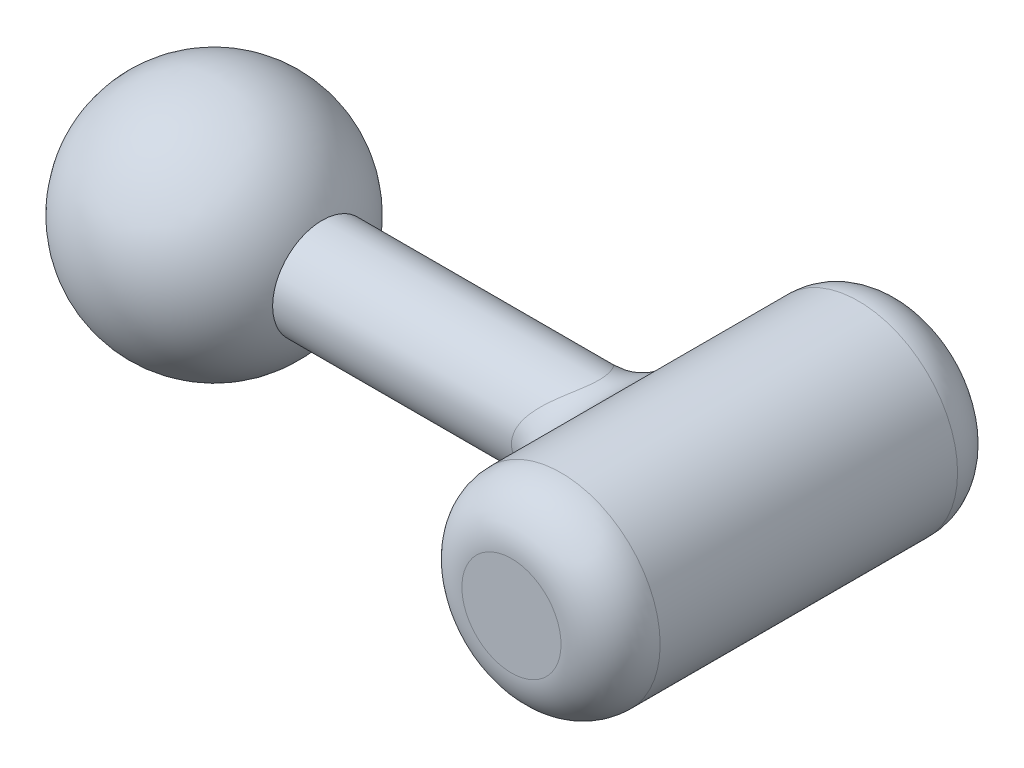
ISO-10303-21;
HEADER;
FILE_DESCRIPTION(('STEP AP214'),'2;1');
FILE_NAME('part.step','',(''),(''),'','','');
FILE_SCHEMA(('AUTOMOTIVE_DESIGN { 1 0 10303 214 1 1 1 1 }'));
ENDSEC;
DATA;
#1=APPLICATION_CONTEXT('core data for automotive mechanical design processes');
#2=APPLICATION_PROTOCOL_DEFINITION('international standard','automotive_design',2000,#1);
#3=PRODUCT_CONTEXT('',#1,'mechanical');
#4=PRODUCT('Part','Part','',(#3));
#5=PRODUCT_RELATED_PRODUCT_CATEGORY('part','',(#4));
#6=PRODUCT_DEFINITION_FORMATION('','',#4);
#7=PRODUCT_DEFINITION_CONTEXT('part definition',#1,'design');
#8=PRODUCT_DEFINITION('design','',#6,#7);
#9=PRODUCT_DEFINITION_SHAPE('','',#8);
#10=(LENGTH_UNIT() NAMED_UNIT(*) SI_UNIT(.MILLI.,.METRE.));
#11=(NAMED_UNIT(*) PLANE_ANGLE_UNIT() SI_UNIT($,.RADIAN.));
#12=(NAMED_UNIT(*) SI_UNIT($,.STERADIAN.) SOLID_ANGLE_UNIT());
#13=UNCERTAINTY_MEASURE_WITH_UNIT(LENGTH_MEASURE(1.E-05),#10,'distance_accuracy_value','');
#14=(GEOMETRIC_REPRESENTATION_CONTEXT(3) GLOBAL_UNCERTAINTY_ASSIGNED_CONTEXT((#13)) GLOBAL_UNIT_ASSIGNED_CONTEXT((#10,
#11,#12)) REPRESENTATION_CONTEXT('',''));
#15=CARTESIAN_POINT('',(0.,0.,0.));
#16=DIRECTION('',(0.,0.,1.));
#17=DIRECTION('',(1.,0.,0.));
#18=AXIS2_PLACEMENT_3D('',#15,#16,#17);
#19=CARTESIAN_POINT('',(0.,0.,0.));
#20=DIRECTION('',(-1.,0.,0.));
#21=DIRECTION('',(0.,0.,1.));
#22=AXIS2_PLACEMENT_3D('',#19,#20,#21);
#23=CYLINDRICAL_SURFACE('',#22,0.5);
#24=CARTESIAN_POINT('',(3.52184133478082,-0.127521528023176,0.483464848660825));
#25=CARTESIAN_POINT('',(3.99408232900824,-0.0513406572577382,0.503558762568019));
#26=CARTESIAN_POINT('',(4.01456088985388,-0.170028704030901,0.966929697321651));
#27=CARTESIAN_POINT('',(3.51279105015493,-0.101298561184406,0.490382051084357));
#28=CARTESIAN_POINT('',(3.99600272163948,-0.0371651215625281,0.502847882715051));
#29=CARTESIAN_POINT('',(4.0085273667444,-0.135064748251369,0.980764102150087));
#30=CARTESIAN_POINT('',(3.50637140856018,-0.0742951002939881,0.495211928569736));
#31=CARTESIAN_POINT('',(3.99797185160982,-0.0259994538347663,0.501463016054571));
#32=CARTESIAN_POINT('',(4.00424760574301,-0.0990601337266775,0.990423857172238));
#33=CARTESIAN_POINT('',(3.49952218501938,-0.0196820859834694,0.50036242436762));
#34=CARTESIAN_POINT('',(4.00012267876693,-0.00617576688331964,0.499933571702085));
#35=CARTESIAN_POINT('',(3.99968145672312,-0.0262427813093579,1.00072484877287));
#36=CARTESIAN_POINT('',(3.49908691348038,0.00792686674692009,0.500687325753362));
#37=CARTESIAN_POINT('',(4.00028115234244,0.00235001943824985,0.499805328114803));
#38=CARTESIAN_POINT('',(3.99939127564276,0.0105691556636595,1.00137465149792));
#39=CARTESIAN_POINT('',(3.50388769808663,0.0589517425504064,0.497080442716341));
#40=CARTESIAN_POINT('',(3.9987429595436,0.0202267642882431,0.500919130396378));
#41=CARTESIAN_POINT('',(4.00259179873377,0.0786023233995912,0.994160885440297));
#42=CARTESIAN_POINT('',(3.50836407206887,0.0824293818000019,0.493718880152731));
#43=CARTESIAN_POINT('',(3.99730822954323,0.0292179252954743,0.501968014962014));
#44=CARTESIAN_POINT('',(4.00557604811335,0.109905842397904,0.987437760361993));
#45=CARTESIAN_POINT('',(3.52142588526069,0.12843331478388,0.483796809867336));
#46=CARTESIAN_POINT('',(3.99406926081824,0.0510499910323585,0.503678331613825));
#47=CARTESIAN_POINT('',(4.01428392356768,0.171244419711325,0.967593619786328));
#48=CARTESIAN_POINT('',(3.53001771771324,0.150958068786396,0.477231324647378));
#49=CARTESIAN_POINT('',(3.99228098723203,0.0637685221540652,0.504337660900992));
#50=CARTESIAN_POINT('',(4.02001181180422,0.201277425050752,0.954462649292458));
#51=CARTESIAN_POINT('',(3.55087825134442,0.195030689511506,0.461007506643267));
#52=CARTESIAN_POINT('',(3.98975921687694,0.0938960487815295,0.503253846462975));
#53=CARTESIAN_POINT('',(4.03391883423432,0.260040919346398,0.922015013288886));
#54=CARTESIAN_POINT('',(3.56322875488546,0.21654307247903,0.451279997966832));
#55=CARTESIAN_POINT('',(3.98903685007,0.111249628691008,0.501502677985305));
#56=CARTESIAN_POINT('',(4.04215250333949,0.288724096628954,0.902559995997294));
#57=CARTESIAN_POINT('',(3.59063648737916,0.257671264009091,0.429129432036974));
#58=CARTESIAN_POINT('',(3.98984362559684,0.1494320747783,0.493776517048959));
#59=CARTESIAN_POINT('',(4.06042432496021,0.343561685362423,0.858258864144806));
#60=CARTESIAN_POINT('',(3.60569615012495,0.277285342646482,0.416703948943551));
#61=CARTESIAN_POINT('',(3.99132379349418,0.170131873082272,0.487902394555358));
#62=CARTESIAN_POINT('',(4.07046410000434,0.369713790246514,0.833407897903804));
#63=CARTESIAN_POINT('',(3.63985447028322,0.317071931707186,0.38750408733394));
#64=CARTESIAN_POINT('',(3.99728669365949,0.216214668318688,0.469832781824353));
#65=CARTESIAN_POINT('',(4.09323631361252,0.422762575550977,0.775008174648765));
#66=CARTESIAN_POINT('',(3.6592223104645,0.336915548908681,0.370360734727741));
#67=CARTESIAN_POINT('',(4.00209597772938,0.241853147250298,0.456987861569799));
#68=CARTESIAN_POINT('',(4.10614820741734,0.449220731649114,0.740721469466311));
#69=CARTESIAN_POINT('',(3.6987225630732,0.373637885412264,0.33328251354333));
#70=CARTESIAN_POINT('',(4.01459029971212,0.292566546928896,0.424278068624746));
#71=CARTESIAN_POINT('',(4.13248170917753,0.498183846983091,0.666565027110476));
#72=CARTESIAN_POINT('',(3.71885633302959,0.390511010691349,0.313342502484164));
#73=CARTESIAN_POINT('',(4.02221583467539,0.317688786576455,0.404556965111983));
#74=CARTESIAN_POINT('',(4.14590422215093,0.520681347522223,0.626685004975099));
#75=CARTESIAN_POINT('',(3.76094215426141,0.423216407964524,0.267916134077052));
#76=CARTESIAN_POINT('',(4.04015941206066,0.368261764980205,0.355321042130125));
#77=CARTESIAN_POINT('',(4.17396143602454,0.564288544028295,0.535832268146376));
#78=CARTESIAN_POINT('',(3.78274945886824,0.438565196230507,0.242044186994596));
#79=CARTESIAN_POINT('',(4.05072574700281,0.393540382674414,0.324836014519819));
#80=CARTESIAN_POINT('',(4.18849963920603,0.584753594993952,0.484088373987115));
#81=CARTESIAN_POINT('',(3.8219756804017,0.46457630820016,0.187298859084677));
#82=CARTESIAN_POINT('',(4.07098339663499,0.437264155373368,0.256431863751106));
#83=CARTESIAN_POINT('',(4.21465045364048,0.619435077580325,0.374597718171424));
#84=CARTESIAN_POINT('',(3.83940646077911,0.475251360806728,0.158433898622795));
#85=CARTESIAN_POINT('',(4.08075415452958,0.455992280635637,0.218478741485344));
#86=CARTESIAN_POINT('',(4.22627097386101,0.633668481071377,0.316867797246175));
#87=CARTESIAN_POINT('',(3.86206786377889,0.488701581086932,0.10781787904234));
#88=CARTESIAN_POINT('',(4.09374900449104,0.479732237292894,0.150005978420062));
#89=CARTESIAN_POINT('',(4.24137857584692,0.65160210811883,0.215635758084279));
#90=CARTESIAN_POINT('',(3.86941128359993,0.492905323764195,0.0866839175618371));
#91=CARTESIAN_POINT('',(4.09809439558991,0.487267182814136,0.120891348248992));
#92=CARTESIAN_POINT('',(4.246274189066,0.657207098352758,0.173367835123295));
#93=CARTESIAN_POINT('',(3.87934626653993,0.498546569004365,0.04378887161618));
#94=CARTESIAN_POINT('',(4.10398525481408,0.497364632985375,0.0613679141402255));
#95=CARTESIAN_POINT('',(4.25289751102724,0.664728758671989,0.0875777432327389));
#96=CARTESIAN_POINT('',(3.88194498621205,0.499988237836604,0.0220287820011238));
#97=CARTESIAN_POINT('',(4.10556023751805,0.499978764521799,0.030837978087025));
#98=CARTESIAN_POINT('',(4.25462999080487,0.666650983783063,0.0440575640033621));
#99=CARTESIAN_POINT('',(3.88198681150441,0.500011636518554,-0.0215262974261801));
#100=CARTESIAN_POINT('',(4.10558524531233,0.500021009015589,-0.0301339239258896));
#101=CARTESIAN_POINT('',(4.25465787433945,0.666682182023813,-0.0430525948534764));
#102=CARTESIAN_POINT('',(3.879422237503,0.498589106303372,-0.0433212909765641));
#103=CARTESIAN_POINT('',(4.10403072668619,0.497441583165691,-0.0607161420762655));
#104=CARTESIAN_POINT('',(4.25294815834867,0.66478547506696,-0.086642581957216));
#105=CARTESIAN_POINT('',(3.86953511059225,0.492976192990467,-0.0862868130132932));
#106=CARTESIAN_POINT('',(4.0981675641146,0.487393499579897,-0.120342774304106));
#107=CARTESIAN_POINT('',(4.24635674038149,0.657301590658164,-0.172573626022493));
#108=CARTESIAN_POINT('',(3.86220602885591,0.488782011755921,-0.107456442884957));
#109=CARTESIAN_POINT('',(4.09382978087993,0.479873905794808,-0.149509335912176));
#110=CARTESIAN_POINT('',(4.24147068585369,0.651709349023811,-0.214912885754647));
#111=CARTESIAN_POINT('',(3.84157071769575,0.476537818724537,-0.153664569281474));
#112=CARTESIAN_POINT('',(4.082004385782,0.458283414485092,-0.211978959551758));
#113=CARTESIAN_POINT('',(4.22771381185953,0.635383758279628,-0.307329138581895));
#114=CARTESIAN_POINT('',(3.82724945080516,0.467801984961387,-0.178405325277322));
#115=CARTESIAN_POINT('',(4.07396021170135,0.44296765673279,-0.244649724554584));
#116=CARTESIAN_POINT('',(4.21816630079575,0.623735979866456,-0.35681065063326));
#117=CARTESIAN_POINT('',(3.79506638429841,0.446886214565755,-0.225754919753516));
#118=CARTESIAN_POINT('',(4.0569963056958,0.407488122617496,-0.304714541812882));
#119=CARTESIAN_POINT('',(4.19671092312269,0.595848286004523,-0.451509839582065));
#120=CARTESIAN_POINT('',(3.77719989790207,0.434701709599361,-0.248360877008813));
#121=CARTESIAN_POINT('',(4.04802073393314,0.38715311891021,-0.332155144394157));
#122=CARTESIAN_POINT('',(4.18479993199277,0.579602279444043,-0.496721754029241));
#123=CARTESIAN_POINT('',(3.73959569760923,0.406977599317246,-0.29161702381691));
#124=CARTESIAN_POINT('',(4.03080476414889,0.342932723573309,-0.381560506993048));
#125=CARTESIAN_POINT('',(4.15973046501373,0.542636799111822,-0.583234047621998));
#126=CARTESIAN_POINT('',(3.71983025483009,0.391381940036078,-0.312225055027575));
#127=CARTESIAN_POINT('',(4.02257284688558,0.318849191526074,-0.403364816412132));
#128=CARTESIAN_POINT('',(4.14655350324792,0.521842586718055,-0.624450110085175));
#129=CARTESIAN_POINT('',(3.68044163576962,0.35718565222604,-0.350833434405619));
#130=CARTESIAN_POINT('',(4.00841688584878,0.26937127462844,-0.440486628881959));
#131=CARTESIAN_POINT('',(4.12029442381853,0.476247536298101,-0.701666868781194));
#132=CARTESIAN_POINT('',(3.66081855355211,0.33858319778756,-0.368832185380648));
#133=CARTESIAN_POINT('',(4.00253949968741,0.243894880663175,-0.455670416496009));
#134=CARTESIAN_POINT('',(4.10721236886401,0.451444263725784,-0.737664370629248));
#135=CARTESIAN_POINT('',(3.62020449683853,0.295296540872935,-0.404610668570646));
#136=CARTESIAN_POINT('',(3.99318872772914,0.189806965083974,-0.481561796676338));
#137=CARTESIAN_POINT('',(4.08013633142409,0.393728721153411,-0.809221337294745));
#138=CARTESIAN_POINT('',(3.599507419002,0.270115292679919,-0.421881945774981));
#139=CARTESIAN_POINT('',(3.99040990262114,0.161539563328819,-0.490816213384731));
#140=CARTESIAN_POINT('',(4.06633828015495,0.360153723523373,-0.843763892172953));
#141=CARTESIAN_POINT('',(3.56270355183905,0.216442377652482,-0.451766521225882));
#142=CARTESIAN_POINT('',(3.98876440269612,0.110417204152977,-0.502090548408749));
#143=CARTESIAN_POINT('',(4.0418023687234,0.28858983681865,-0.90353304308108));
#144=CARTESIAN_POINT('',(3.54658384852199,0.187960349876281,-0.464392954202645));
#145=CARTESIAN_POINT('',(3.99001092271661,0.0878341617116402,-0.503881710581803));
#146=CARTESIAN_POINT('',(4.03105589923741,0.25061379982137,-0.928785908574047));
#147=CARTESIAN_POINT('',(3.52072021149345,0.127988454385187,-0.484383316511721));
#148=CARTESIAN_POINT('',(3.99390747775483,0.0498896360511994,-0.504098001590069));
#149=CARTESIAN_POINT('',(4.01381347410303,0.17065127252745,-0.968766632852271));
#150=CARTESIAN_POINT('',(3.51107081975549,0.0964613757069334,-0.491669350715534));
#151=CARTESIAN_POINT('',(3.99658921050644,0.0350397792621662,-0.502389648174329));
#152=CARTESIAN_POINT('',(4.0073805464481,0.128615167612305,-0.983338701388937));
#153=CARTESIAN_POINT('',(3.50140907438057,0.0404531164859,-0.498946866562786));
#154=CARTESIAN_POINT('',(3.99949220597319,0.0132913358810754,-0.500406555939149));
#155=CARTESIAN_POINT('',(4.00093938296179,0.0539374886455855,-0.997893733156976));
#156=CARTESIAN_POINT('',(3.49956853650609,0.0162218229495406,-0.500323312126748));
#157=CARTESIAN_POINT('',(4.00014427054412,0.00543340310684889,-0.499891013579184));
#158=CARTESIAN_POINT('',(3.99971235768976,0.0216290972657961,-1.00064662426802));
#159=CARTESIAN_POINT('',(3.50060136621171,-0.0321856874239827,-0.499549256578989));
#160=CARTESIAN_POINT('',(3.99979931619985,-0.0107508536418068,-0.500151268980534));
#161=CARTESIAN_POINT('',(4.00040091079033,-0.0429142498983834,-0.999098513144836));
#162=CARTESIAN_POINT('',(3.50347863346425,-0.0563618421399533,-0.49739583773064));
#163=CARTESIAN_POINT('',(3.99880426811833,-0.0190005490565779,-0.500925570106477));
#164=CARTESIAN_POINT('',(4.00231908894456,-0.0751491228545185,-0.994791675437361));
#165=CARTESIAN_POINT('',(3.51367672543545,-0.10382386878632,-0.489691058016191));
#166=CARTESIAN_POINT('',(3.99592454335499,-0.0387862312049883,-0.502753661100116));
#167=CARTESIAN_POINT('',(4.00911781698846,-0.138431825047184,-0.979382116056216));
#168=CARTESIAN_POINT('',(3.52098170127544,-0.127112602654453,-0.484151816029614));
#169=CARTESIAN_POINT('',(3.99406385391302,-0.0501950587926409,-0.503796023836604));
#170=CARTESIAN_POINT('',(4.01398780095867,-0.169483470200716,-0.968303632141344));
#171=CARTESIAN_POINT('',(3.53941373555008,-0.172355688773135,-0.469954439183359));
#172=CARTESIAN_POINT('',(3.99094744377844,-0.0775519302210858,-0.504132889359818));
#173=CARTESIAN_POINT('',(4.02627582379665,-0.229807585026489,-0.9399088784384));
#174=CARTESIAN_POINT('',(3.55054810033396,-0.194307395080862,-0.461290340649657));
#175=CARTESIAN_POINT('',(3.98969227428277,-0.0933486155710695,-0.503452359880575));
#176=CARTESIAN_POINT('',(4.03369873356359,-0.259076526774984,-0.922580681302038));
#177=CARTESIAN_POINT('',(3.5763581118039,-0.237356815517952,-0.440744639642371));
#178=CARTESIAN_POINT('',(3.98909645949429,-0.129634908149363,-0.498310692985403));
#179=CARTESIAN_POINT('',(4.05090540786132,-0.316475754023412,-0.881489279281897));
#180=CARTESIAN_POINT('',(3.59116844425149,-0.258373991802501,-0.428737832820021));
#181=CARTESIAN_POINT('',(3.98979847945146,-0.150153403711364,-0.493777974502008));
#182=CARTESIAN_POINT('',(4.06077896290714,-0.344498655729776,-0.857475665706568));
#183=CARTESIAN_POINT('',(3.62298734962222,-0.298194077948018,-0.402064180361248));
#184=CARTESIAN_POINT('',(3.99397503979462,-0.193611601059413,-0.479403857366444));
#185=CARTESIAN_POINT('',(4.08199156640208,-0.397592103969832,-0.804128360781921));
#186=CARTESIAN_POINT('',(3.63999784634243,-0.316995022134595,-0.387395002199136));
#187=CARTESIAN_POINT('',(3.99738250312868,-0.216462704673681,-0.469695703239499));
#188=CARTESIAN_POINT('',(4.09333189738237,-0.422660029604387,-0.774790004381096));
#189=CARTESIAN_POINT('',(3.67797285521593,-0.355083799506232,-0.353094866286753));
#190=CARTESIAN_POINT('',(4.00755787920031,-0.266140588961338,-0.442530188504588));
#191=CARTESIAN_POINT('',(4.11864857035257,-0.473445065901713,-0.706189732593497));
#192=CARTESIAN_POINT('',(3.69912863684804,-0.373946950526896,-0.333044749627684));
#193=CARTESIAN_POINT('',(4.01472097167133,-0.293122143340078,-0.424192295148512));
#194=CARTESIAN_POINT('',(4.13275242545092,-0.498595933627569,-0.666089499422367));
#195=CARTESIAN_POINT('',(3.74099503986073,-0.408202847376977,-0.290045688357789));
#196=CARTESIAN_POINT('',(4.03129312254594,-0.344578410454103,-0.379963291438123));
#197=CARTESIAN_POINT('',(4.16066336068982,-0.544270462845029,-0.580091376891349));
#198=CARTESIAN_POINT('',(3.76170545566512,-0.423594020417471,-0.267095437315363));
#199=CARTESIAN_POINT('',(4.04067061075803,-0.369185807588582,-0.354194376699175));
#200=CARTESIAN_POINT('',(4.17447030377892,-0.564792027285046,-0.534190874668135));
#201=CARTESIAN_POINT('',(3.79788651966713,-0.44882029622528,-0.221685036248219));
#202=CARTESIAN_POINT('',(4.05839607905589,-0.410646836965155,-0.299650388930126));
#203=CARTESIAN_POINT('',(4.19859101310953,-0.598427061579983,-0.443370072463892));
#204=CARTESIAN_POINT('',(3.8136883323515,-0.459117569523088,-0.199549004919882));
#205=CARTESIAN_POINT('',(4.06672640763504,-0.428186968525057,-0.271770206900846));
#206=CARTESIAN_POINT('',(4.20912555548634,-0.612156758917741,-0.399098009851084));
#207=CARTESIAN_POINT('',(3.84141312249101,-0.476490630113279,-0.153491086948804));
#208=CARTESIAN_POINT('',(4.08185897242439,-0.458124223083907,-0.211781826977859));
#209=CARTESIAN_POINT('',(4.22760874899437,-0.635320839673609,-0.306982173929077));
#210=CARTESIAN_POINT('',(3.85334410696569,-0.483573079721197,-0.129573014302592));
#211=CARTESIAN_POINT('',(4.08871857742693,-0.47066778870006,-0.179606068233513));
#212=CARTESIAN_POINT('',(4.2355627381409,-0.64476410617753,-0.259146028613077));
#213=CARTESIAN_POINT('',(3.87005248483997,-0.493294495890591,-0.0843092774444932));
#214=CARTESIAN_POINT('',(4.09844453521896,-0.487930315944346,-0.117680658613023));
#215=CARTESIAN_POINT('',(4.24670165642212,-0.657725994619609,-0.168618554882343));
#216=CARTESIAN_POINT('',(3.87566313724886,-0.496459271947208,-0.0631554989737124));
#217=CARTESIAN_POINT('',(4.10180244391184,-0.49363326191959,-0.0882815029463915));
#218=CARTESIAN_POINT('',(4.25044209146407,-0.661945695955339,-0.126310997945251));
#219=CARTESIAN_POINT('',(3.88202697803735,-0.500040399025938,-0.0204411950655324));
#220=CARTESIAN_POINT('',(4.10560133920146,-0.500063819341513,-0.0286985472936018));
#221=CARTESIAN_POINT('',(4.25468465206005,-0.666720532008878,-0.0408823901332363));
#222=CARTESIAN_POINT('',(3.88278422239505,-0.50045904498734,0.00111897563288517));
#223=CARTESIAN_POINT('',(4.10606137410979,-0.500823813904303,0.00161233802312721));
#224=CARTESIAN_POINT('',(4.25518948159959,-0.667278726645657,0.00223795126372002));
#225=CARTESIAN_POINT('',(3.87932823458954,-0.498522855075658,0.0439938070479997));
#226=CARTESIAN_POINT('',(4.10399164284425,-0.497341490542817,0.0615699305970325));
#227=CARTESIAN_POINT('',(4.25288548972347,-0.664697140105002,0.0879876140980484));
#228=CARTESIAN_POINT('',(3.87511824012576,-0.496169825811801,0.0653086185524848));
#229=CARTESIAN_POINT('',(4.10145458337811,-0.493086926842089,0.0913494805040285));
#230=CARTESIAN_POINT('',(4.25007882677406,-0.661559767739893,0.130617237110994));
#231=CARTESIAN_POINT('',(3.86236579854271,-0.48884559505039,0.107157679595021));
#232=CARTESIAN_POINT('',(4.09395940109933,-0.480029682637121,0.149025762121431));
#233=CARTESIAN_POINT('',(4.24157719900489,-0.65179412674304,0.214315359184008));
#234=CARTESIAN_POINT('',(3.85381748837745,-0.483870850066965,0.127690832278432));
#235=CARTESIAN_POINT('',(4.08896827714085,-0.471167114315308,0.177027628877919));
#236=CARTESIAN_POINT('',(4.23587832548768,-0.645161133463528,0.255381664534772));
#237=CARTESIAN_POINT('',(3.83030411760615,-0.469639769930986,0.173737316323215));
#238=CARTESIAN_POINT('',(4.07571208932397,-0.446254262111703,0.238511884258374));
#239=CARTESIAN_POINT('',(4.22020274519801,-0.626186359854479,0.347474632675323));
#240=CARTESIAN_POINT('',(3.81417383075854,-0.459536846923501,0.19883805566957));
#241=CARTESIAN_POINT('',(4.06686749989531,-0.428726461650199,0.271040068448645));
#242=CARTESIAN_POINT('',(4.20944922105265,-0.612715795666768,0.397676111462182));
#243=CARTESIAN_POINT('',(3.77877300781804,-0.435741752691431,0.246668662281888));
#244=CARTESIAN_POINT('',(4.04883844052546,-0.388978183864048,0.330165156586483));
#245=CARTESIAN_POINT('',(4.18584867232643,-0.580989003411079,0.493337324687953));
#246=CARTESIAN_POINT('',(3.75949792937687,-0.422044371943744,0.269395020916639));
#247=CARTESIAN_POINT('',(4.03960493387481,-0.366569153937266,0.356779140260444));
#248=CARTESIAN_POINT('',(4.17299861951202,-0.562725829312894,0.538790041864167));
#249=CARTESIAN_POINT('',(3.71956262741112,-0.391107639323611,0.312656533984662));
#250=CARTESIAN_POINT('',(4.02247862369241,-0.318557232379083,0.403897637613881));
#251=CARTESIAN_POINT('',(4.14637508501462,-0.521476852375928,0.625313067937877));
#252=CARTESIAN_POINT('',(3.69888368993835,-0.373808853101025,0.333144768041585));
#253=CARTESIAN_POINT('',(4.01462516133008,-0.292766033320227,0.424189940676857));
#254=CARTESIAN_POINT('',(4.13258912738775,-0.498411803726525,0.666289536084948));
#255=CARTESIAN_POINT('',(3.65831198999661,-0.336047706793548,0.3712014993418));
#256=CARTESIAN_POINT('',(4.00181559699052,-0.240654606138007,0.457718526646003));
#257=CARTESIAN_POINT('',(4.10554132749415,-0.448063608614005,0.742402998686223));
#258=CARTESIAN_POINT('',(3.63841934120227,-0.31558489136664,0.388769575582832));
#259=CARTESIAN_POINT('',(3.99693091987662,-0.214284411332484,0.470782448834578));
#260=CARTESIAN_POINT('',(4.09227956101032,-0.420779855028293,0.777539151135897));
#261=CARTESIAN_POINT('',(3.59895879631921,-0.269211886174379,0.422415992790061));
#262=CARTESIAN_POINT('',(3.99025106630382,-0.160808387530586,0.491314865256043));
#263=CARTESIAN_POINT('',(4.06597253064696,-0.358949181707508,0.844831985613266));
#264=CARTESIAN_POINT('',(3.57968412731016,-0.242947009037806,0.438098812981971));
#265=CARTESIAN_POINT('',(3.98901724351575,-0.13418043630763,0.497673017057367));
#266=CARTESIAN_POINT('',(4.0531227515861,-0.323929345431983,0.8761976261073));
#267=CARTESIAN_POINT('',(3.54637809653372,-0.187309222973293,0.464607996808152));
#268=CARTESIAN_POINT('',(3.98979563098697,-0.0873503859736088,0.504295466817029));
#269=CARTESIAN_POINT('',(4.03091873119927,-0.249745630605352,0.929215993753743));
#270=CARTESIAN_POINT('',(3.53233978017384,-0.157940503423331,0.475440805780664));
#271=CARTESIAN_POINT('',(3.99189536214405,-0.0674839325147208,0.504368321330936));
#272=CARTESIAN_POINT('',(4.02155985347887,-0.210587337891401,0.950881611582938));
#273=CARTESIAN_POINT('',(3.52184133478082,-0.127521528023176,0.483464848660825));
#274=CARTESIAN_POINT('',(3.99408232900824,-0.0513406572577382,0.503558762568019));
#275=CARTESIAN_POINT('',(4.01456088985388,-0.170028704030901,0.966929697321651));
#276=(BOUNDED_SURFACE() B_SPLINE_SURFACE(3,2,((#24,#25,#26),(#27,#28,#29),(#30,#31,#32),(#33,
#34,#35),(#36,#37,#38),(#39,#40,#41),(#42,#43,#44),(#45,#46,#47),(#48,#49,#50),(#51,#52,#53),
(#54,#55,#56),(#57,#58,#59),(#60,#61,#62),(#63,#64,#65),(#66,#67,#68),(#69,#70,#71),(#72,#73,
#74),(#75,#76,#77),(#78,#79,#80),(#81,#82,#83),(#84,#85,#86),(#87,#88,#89),(#90,#91,#92),(#93,
#94,#95),(#96,#97,#98),(#99,#100,#101),(#102,#103,#104),(#105,#106,#107),(#108,#109,#110),(#111,
#112,#113),(#114,#115,#116),(#117,#118,#119),(#120,#121,#122),(#123,#124,#125),(#126,#127,#128),
(#129,#130,#131),(#132,#133,#134),(#135,#136,#137),(#138,#139,#140),(#141,#142,#143),(#144,#145,
#146),(#147,#148,#149),(#150,#151,#152),(#153,#154,#155),(#156,#157,#158),(#159,#160,#161),
(#162,#163,#164),(#165,#166,#167),(#168,#169,#170),(#171,#172,#173),(#174,#175,#176),(#177,#178,
#179),(#180,#181,#182),(#183,#184,#185),(#186,#187,#188),(#189,#190,#191),(#192,#193,#194),
(#195,#196,#197),(#198,#199,#200),(#201,#202,#203),(#204,#205,#206),(#207,#208,#209),(#210,#211,
#212),(#213,#214,#215),(#216,#217,#218),(#219,#220,#221),(#222,#223,#224),(#225,#226,#227),
(#228,#229,#230),(#231,#232,#233),(#234,#235,#236),(#237,#238,#239),(#240,#241,#242),(#243,#244,
#245),(#246,#247,#248),(#249,#250,#251),(#252,#253,#254),(#255,#256,#257),(#258,#259,#260),
(#261,#262,#263),(#264,#265,#266),(#267,#268,#269),(#270,#271,#272),(#273,#274,#275)),
.UNSPECIFIED.,.T.,.F.,.F.) B_SPLINE_SURFACE_WITH_KNOTS((4,2,2,2,2,2,2,2,2,2,2,2,2,2,2,2,2,2,2,2,
2,2,2,2,2,2,2,2,2,2,2,2,2,2,2,2,2,2,2,2,2,4),(3,3),(0.,0.164706722416851,0.329256840367123,
0.471533856245099,0.614032615632238,0.759886225987761,0.905871525353147,1.07295283601793,
1.24034550414467,1.43137713994849,1.62188521530984,1.75248921385455,1.88289605577471,
2.0134970015183,2.14427728865438,2.30658768009745,2.46911409286699,2.63454425612972,
2.80007525874424,2.99243909688545,3.18425470753346,3.37881530563164,3.52383751715321,
3.6689796624685,3.81360531800214,3.95850845961363,4.10981142696607,4.26124759766929,
4.43748893243788,4.6138099440549,4.76721010672252,4.92029089905854,5.04914703620728,
5.17789547462458,5.30656003977166,5.43539895440559,5.60389722637338,5.7726410682675,
5.94442876606959,6.11624120924561,6.30755811175368,6.49862000678041),(0.,1.),
.UNSPECIFIED.) GEOMETRIC_REPRESENTATION_ITEM() RATIONAL_B_SPLINE_SURFACE(((1.,0.722275792302235,
1.),(1.,0.716104002871917,1.),(1.,0.711593817441428,1.),(1.,0.70677694007179,1.),(1.,
0.706466255494841,1.),(1.,0.709848340095001,1.),(1.,0.713004903809704,1.),(1.,0.722015687975438,
1.),(1.,0.727874105147745,1.),(1.,0.74168723590365,1.),(1.,0.749688055466269,1.),(1.,
0.766833945885869,1.),(1.,0.77598004334769,1.),(1.,0.795963357608283,1.),(1.,0.806853960943265,
1.),(1.,0.828132759963544,1.),(1.,0.838519981588446,1.),(1.,0.859380311567281,1.),(1.,
0.869658399392504,1.),(1.,0.887484954542479,1.),(1.,0.895040825735467,1.),(1.,0.904663122814229,
1.),(1.,0.907708584683789,1.),(1.,0.911806682855178,1.),(1.,0.912862320538035,1.),(1.,
0.912879446082439,1.),(1.,0.911837814571805,1.),(1.,0.907759849122391,1.),(1.,0.90472077801977,
1.),(1.,0.895961004356011,1.),(1.,0.889770428765401,1.),(1.,0.87531861607956,1.),(1.,
0.867054634075559,1.),(1.,0.848918948990649,1.),(1.,0.839021159745237,1.),(1.,0.818428061111784,
1.),(1.,0.807732269266247,1.),(1.,0.784664286602918,1.),(1.,0.772301401336994,1.),(1.,
0.7494249664693,1.),(1.,0.738906246765769,1.),(1.,0.721606811926759,1.),(1.,0.714881743852388,
1.),(1.,0.708111529930694,1.),(1.,0.70680154807985,1.),(1.,0.707532145311433,1.),(1.,
0.709575496213508,1.),(1.,0.716682764418152,1.),(1.,0.721735907129913,1.),(1.,0.734140118030575,
1.),(1.,0.741495576533481,1.),(1.,0.757985721822919,1.),(1.,0.767184642448758,1.),(1.,
0.786206493263896,1.),(1.,0.796029965685901,1.),(1.,0.817117416212743,1.),(1.,0.828353782008278,
1.),(1.,0.849644353225408,1.),(1.,0.859698021908224,1.),(1.,0.876621644487667,1.),(1.,
0.883735571453613,1.),(1.,0.895913346476213,1.),(1.,0.900981431844246,1.),(1.,0.90798503340744,
1.),(1.,0.910289354499232,1.),(1.,0.912898913162837,1.),(1.,0.913205819970899,1.),(1.,
0.911792750476293,1.),(1.,0.910074094457956,1.),(1.,0.904774064449467,1.),(1.,0.901190169501975,
1.),(1.,0.891082130674699,1.),(1.,0.883992503786389,1.),(1.,0.86777756113558,1.),(1.,
0.858649293612073,1.),(1.,0.838884650910354,1.),(1.,0.828224042164958,1.),(1.,0.806359017886494,
1.),(1.,0.795154524241296,1.),(1.,0.772000897416349,1.),(1.,0.760111625972351,1.),(1.,
0.73883040436007,1.),(1.,0.729435146619771,1.),(1.,0.722275792302235,1.))) REPRESENTATION_ITEM('') SURFACE());
#277=CARTESIAN_POINT('',(3.52184133478082,-0.127521528023176,0.483464848660825));
#278=CARTESIAN_POINT('',(3.51279105015493,-0.101298561184406,0.490382051084357));
#279=CARTESIAN_POINT('',(3.50637140856018,-0.0742951002939881,0.495211928569736));
#280=CARTESIAN_POINT('',(3.49952218501938,-0.0196820859834694,0.50036242436762));
#281=CARTESIAN_POINT('',(3.49908691348038,0.00792686674692009,0.500687325753362));
#282=CARTESIAN_POINT('',(3.50388769808663,0.0589517425504064,0.497080442716341));
#283=CARTESIAN_POINT('',(3.50836407206886,0.0824293818000019,0.493718880152731));
#284=CARTESIAN_POINT('',(3.52142588526069,0.12843331478388,0.483796809867336));
#285=CARTESIAN_POINT('',(3.53001771771324,0.150958068786396,0.477231324647378));
#286=CARTESIAN_POINT('',(3.55087825134442,0.195030689511506,0.461007506643267));
#287=CARTESIAN_POINT('',(3.56322875488546,0.21654307247903,0.451279997966832));
#288=CARTESIAN_POINT('',(3.59063648737916,0.257671264009091,0.429129432036974));
#289=CARTESIAN_POINT('',(3.60569615012495,0.277285342646482,0.416703948943551));
#290=CARTESIAN_POINT('',(3.63985447028322,0.317071931707186,0.38750408733394));
#291=CARTESIAN_POINT('',(3.6592223104645,0.336915548908681,0.370360734727741));
#292=CARTESIAN_POINT('',(3.6987225630732,0.373637885412264,0.33328251354333));
#293=CARTESIAN_POINT('',(3.71885633302959,0.390511010691349,0.313342502484164));
#294=CARTESIAN_POINT('',(3.76094215426141,0.423216407964524,0.267916134077052));
#295=CARTESIAN_POINT('',(3.78274945886824,0.438565196230507,0.242044186994596));
#296=CARTESIAN_POINT('',(3.8219756804017,0.46457630820016,0.187298859084677));
#297=CARTESIAN_POINT('',(3.83940646077911,0.475251360806728,0.158433898622795));
#298=CARTESIAN_POINT('',(3.86206786377889,0.488701581086932,0.10781787904234));
#299=CARTESIAN_POINT('',(3.86941128359993,0.492905323764195,0.0866839175618371));
#300=CARTESIAN_POINT('',(3.87934626653993,0.498546569004365,0.04378887161618));
#301=CARTESIAN_POINT('',(3.88194498621205,0.499988237836605,0.0220287820011238));
#302=CARTESIAN_POINT('',(3.88198681150441,0.500011636518554,-0.0215262974261802));
#303=CARTESIAN_POINT('',(3.879422237503,0.498589106303372,-0.0433212909765641));
#304=CARTESIAN_POINT('',(3.86953511059225,0.492976192990467,-0.0862868130132932));
#305=CARTESIAN_POINT('',(3.86220602885591,0.488782011755921,-0.107456442884957));
#306=CARTESIAN_POINT('',(3.84157071769575,0.476537818724537,-0.153664569281474));
#307=CARTESIAN_POINT('',(3.82724945080516,0.467801984961387,-0.178405325277322));
#308=CARTESIAN_POINT('',(3.79506638429841,0.446886214565755,-0.225754919753516));
#309=CARTESIAN_POINT('',(3.77719989790207,0.434701709599361,-0.248360877008813));
#310=CARTESIAN_POINT('',(3.73959569760923,0.406977599317246,-0.29161702381691));
#311=CARTESIAN_POINT('',(3.71983025483009,0.391381940036078,-0.312225055027575));
#312=CARTESIAN_POINT('',(3.68044163576962,0.35718565222604,-0.350833434405619));
#313=CARTESIAN_POINT('',(3.66081855355211,0.33858319778756,-0.368832185380648));
#314=CARTESIAN_POINT('',(3.62020449683853,0.295296540872935,-0.404610668570646));
#315=CARTESIAN_POINT('',(3.599507419002,0.270115292679919,-0.421881945774981));
#316=CARTESIAN_POINT('',(3.56270355183905,0.216442377652482,-0.451766521225882));
#317=CARTESIAN_POINT('',(3.54658384852199,0.187960349876281,-0.464392954202645));
#318=CARTESIAN_POINT('',(3.52072021149345,0.127988454385187,-0.484383316511721));
#319=CARTESIAN_POINT('',(3.51107081975549,0.0964613757069334,-0.491669350715534));
#320=CARTESIAN_POINT('',(3.50140907438057,0.0404531164859,-0.498946866562786));
#321=CARTESIAN_POINT('',(3.49956853650609,0.0162218229495406,-0.500323312126748));
#322=CARTESIAN_POINT('',(3.50060136621171,-0.0321856874239827,-0.499549256578989));
#323=CARTESIAN_POINT('',(3.50347863346425,-0.0563618421399533,-0.49739583773064));
#324=CARTESIAN_POINT('',(3.51367672543545,-0.10382386878632,-0.489691058016191));
#325=CARTESIAN_POINT('',(3.52098170127544,-0.127112602654453,-0.484151816029614));
#326=CARTESIAN_POINT('',(3.53941373555008,-0.172355688773135,-0.469954439183359));
#327=CARTESIAN_POINT('',(3.55054810033396,-0.194307395080862,-0.461290340649657));
#328=CARTESIAN_POINT('',(3.5763581118039,-0.237356815517952,-0.440744639642371));
#329=CARTESIAN_POINT('',(3.59116844425149,-0.258373991802501,-0.428737832820021));
#330=CARTESIAN_POINT('',(3.62298734962222,-0.298194077948018,-0.402064180361248));
#331=CARTESIAN_POINT('',(3.63999784634243,-0.316995022134595,-0.387395002199136));
#332=CARTESIAN_POINT('',(3.67797285521593,-0.355083799506232,-0.353094866286753));
#333=CARTESIAN_POINT('',(3.69912863684804,-0.373946950526896,-0.333044749627684));
#334=CARTESIAN_POINT('',(3.74099503986072,-0.408202847376977,-0.290045688357789));
#335=CARTESIAN_POINT('',(3.76170545566512,-0.423594020417471,-0.267095437315363));
#336=CARTESIAN_POINT('',(3.79788651966713,-0.44882029622528,-0.221685036248219));
#337=CARTESIAN_POINT('',(3.8136883323515,-0.459117569523088,-0.199549004919882));
#338=CARTESIAN_POINT('',(3.84141312249101,-0.476490630113279,-0.153491086948804));
#339=CARTESIAN_POINT('',(3.85334410696569,-0.483573079721197,-0.129573014302592));
#340=CARTESIAN_POINT('',(3.87005248483997,-0.493294495890591,-0.0843092774444932));
#341=CARTESIAN_POINT('',(3.87566313724886,-0.496459271947208,-0.0631554989737124));
#342=CARTESIAN_POINT('',(3.88202697803735,-0.500040399025938,-0.0204411950655324));
#343=CARTESIAN_POINT('',(3.88278422239505,-0.50045904498734,0.00111897563288518));
#344=CARTESIAN_POINT('',(3.87932823458954,-0.498522855075658,0.0439938070479997));
#345=CARTESIAN_POINT('',(3.87511824012576,-0.496169825811801,0.0653086185524849));
#346=CARTESIAN_POINT('',(3.86236579854271,-0.48884559505039,0.107157679595021));
#347=CARTESIAN_POINT('',(3.85381748837745,-0.483870850066965,0.127690832278432));
#348=CARTESIAN_POINT('',(3.83030411760615,-0.469639769930986,0.173737316323215));
#349=CARTESIAN_POINT('',(3.81417383075854,-0.459536846923501,0.19883805566957));
#350=CARTESIAN_POINT('',(3.77877300781804,-0.435741752691431,0.246668662281888));
#351=CARTESIAN_POINT('',(3.75949792937687,-0.422044371943744,0.269395020916639));
#352=CARTESIAN_POINT('',(3.71956262741112,-0.391107639323611,0.312656533984662));
#353=CARTESIAN_POINT('',(3.69888368993835,-0.373808853101025,0.333144768041585));
#354=CARTESIAN_POINT('',(3.65831198999661,-0.336047706793548,0.3712014993418));
#355=CARTESIAN_POINT('',(3.63841934120227,-0.31558489136664,0.388769575582832));
#356=CARTESIAN_POINT('',(3.59895879631921,-0.269211886174379,0.422415992790061));
#357=CARTESIAN_POINT('',(3.57968412731016,-0.242947009037806,0.438098812981971));
#358=CARTESIAN_POINT('',(3.54637809653372,-0.187309222973293,0.464607996808152));
#359=CARTESIAN_POINT('',(3.53233978017384,-0.157940503423331,0.475440805780664));
#360=CARTESIAN_POINT('',(3.52184133478082,-0.127521528023176,0.483464848660825));
#361=B_SPLINE_CURVE_WITH_KNOTS('',3,(#277,#278,#279,#280,#281,#282,#283,#284,#285,#286,#287,
#288,#289,#290,#291,#292,#293,#294,#295,#296,#297,#298,#299,#300,#301,#302,#303,#304,#305,#306,
#307,#308,#309,#310,#311,#312,#313,#314,#315,#316,#317,#318,#319,#320,#321,#322,#323,#324,#325,
#326,#327,#328,#329,#330,#331,#332,#333,#334,#335,#336,#337,#338,#339,#340,#341,#342,#343,#344,
#345,#346,#347,#348,#349,#350,#351,#352,#353,#354,#355,#356,#357,#358,#359,#360),.UNSPECIFIED.,
.T.,.F.,(4,2,2,2,2,2,2,2,2,2,2,2,2,2,2,2,2,2,2,2,2,2,2,2,2,2,2,2,2,2,2,2,2,2,2,2,2,2,2,2,2,4),
(0.,0.164706722416851,0.329256840367123,0.471533856245099,0.614032615632238,0.759886225987761,
0.905871525353147,1.07295283601793,1.24034550414467,1.43137713994849,1.62188521530984,
1.75248921385455,1.88289605577471,2.0134970015183,2.14427728865438,2.30658768009745,
2.46911409286699,2.63454425612972,2.80007525874424,2.99243909688545,3.18425470753346,
3.37881530563164,3.52383751715321,3.6689796624685,3.81360531800214,3.95850845961363,
4.10981142696607,4.26124759766929,4.43748893243788,4.6138099440549,4.76721010672252,
4.92029089905854,5.04914703620728,5.17789547462458,5.30656003977166,5.43539895440559,
5.60389722637338,5.7726410682675,5.94442876606959,6.11624120924561,6.30755811175368,
6.49862000678041),.UNSPECIFIED.);
#362=CARTESIAN_POINT('',(3.52184133478082,-0.127521528023176,0.483464848660825));
#363=VERTEX_POINT('',#362);
#364=EDGE_CURVE('E54',#363,#363,#361,.T.);
#365=ORIENTED_EDGE('',*,*,#364,.T.);
#366=EDGE_LOOP('',(#365));
#367=FACE_BOUND('',#366,.T.);
#368=CARTESIAN_POINT('',(1.09087121146357,0.,0.));
#369=DIRECTION('',(-1.,0.,0.));
#370=DIRECTION('',(0.,0.,1.));
#371=AXIS2_PLACEMENT_3D('',#368,#369,#370);
#372=CIRCLE('',#371,0.5);
#373=CARTESIAN_POINT('',(1.09087121146357,0.,0.5));
#374=VERTEX_POINT('',#373);
#375=EDGE_CURVE('E162',#374,#374,#372,.T.);
#376=ORIENTED_EDGE('',*,*,#375,.F.);
#377=EDGE_LOOP('',(#376));
#378=FACE_BOUND('',#377,.T.);
#379=ADVANCED_FACE('F36',(#367,#378),#23,.T.);
#380=CARTESIAN_POINT('',(0.,0.,0.));
#381=DIRECTION('',(-1.,0.,0.));
#382=DIRECTION('',(0.,1.,0.));
#383=AXIS2_PLACEMENT_3D('',#380,#381,#382);
#384=SPHERICAL_SURFACE('',#383,1.2);
#385=ORIENTED_EDGE('',*,*,#375,.T.);
#386=EDGE_LOOP('',(#385));
#387=FACE_BOUND('',#386,.T.);
#388=ADVANCED_FACE('F77',(#387),#384,.T.);
#389=CARTESIAN_POINT('',(5.,0.,2.));
#390=DIRECTION('',(0.,0.,-1.));
#391=DIRECTION('',(-1.,0.,0.));
#392=AXIS2_PLACEMENT_3D('',#389,#390,#391);
#393=CYLINDRICAL_SURFACE('',#392,1.);
#394=CARTESIAN_POINT('',(4.01456088985388,-0.170028704030901,0.966929697321651));
#395=CARTESIAN_POINT('',(4.02155985347887,-0.210587337891401,0.950881611582938));
#396=CARTESIAN_POINT('',(4.03091873119927,-0.249745630605352,0.929215993753743));
#397=CARTESIAN_POINT('',(4.0531227515861,-0.323929345431983,0.8761976261073));
#398=CARTESIAN_POINT('',(4.06597253064696,-0.358949181707508,0.844831985613266));
#399=CARTESIAN_POINT('',(4.09227956101032,-0.420779855028293,0.777539151135897));
#400=CARTESIAN_POINT('',(4.10554132749415,-0.448063608614005,0.742402998686223));
#401=CARTESIAN_POINT('',(4.13258912738775,-0.498411803726525,0.666289536084948));
#402=CARTESIAN_POINT('',(4.14637508501462,-0.521476852375928,0.625313067937877));
#403=CARTESIAN_POINT('',(4.17299861951202,-0.562725829312894,0.538790041864167));
#404=CARTESIAN_POINT('',(4.18584867232643,-0.580989003411079,0.493337324687953));
#405=CARTESIAN_POINT('',(4.20944922105265,-0.612715795666768,0.397676111462183));
#406=CARTESIAN_POINT('',(4.22020274519801,-0.626186359854479,0.347474632675323));
#407=CARTESIAN_POINT('',(4.23587832548768,-0.645161133463528,0.255381664534772));
#408=CARTESIAN_POINT('',(4.24157719900489,-0.65179412674304,0.214315359184008));
#409=CARTESIAN_POINT('',(4.25007882677406,-0.661559767739893,0.130617237110994));
#410=CARTESIAN_POINT('',(4.25288548972347,-0.664697140105002,0.0879876140980485));
#411=CARTESIAN_POINT('',(4.25518948159959,-0.667278726645657,0.00223795126372004));
#412=CARTESIAN_POINT('',(4.25468465206005,-0.666720532008878,-0.0408823901332363));
#413=CARTESIAN_POINT('',(4.25044209146407,-0.661945695955339,-0.126310997945252));
#414=CARTESIAN_POINT('',(4.24670165642212,-0.657725994619609,-0.168618554882343));
#415=CARTESIAN_POINT('',(4.2355627381409,-0.64476410617753,-0.259146028613077));
#416=CARTESIAN_POINT('',(4.22760874899437,-0.635320839673609,-0.306982173929077));
#417=CARTESIAN_POINT('',(4.20912555548634,-0.612156758917741,-0.399098009851084));
#418=CARTESIAN_POINT('',(4.19859101310953,-0.598427061579983,-0.443370072463892));
#419=CARTESIAN_POINT('',(4.17447030377892,-0.564792027285046,-0.534190874668136));
#420=CARTESIAN_POINT('',(4.16066336068982,-0.544270462845029,-0.580091376891349));
#421=CARTESIAN_POINT('',(4.13275242545092,-0.498595933627569,-0.666089499422367));
#422=CARTESIAN_POINT('',(4.11864857035257,-0.473445065901713,-0.706189732593497));
#423=CARTESIAN_POINT('',(4.09333189738237,-0.422660029604387,-0.774790004381096));
#424=CARTESIAN_POINT('',(4.08199156640208,-0.397592103969832,-0.804128360781921));
#425=CARTESIAN_POINT('',(4.06077896290714,-0.344498655729776,-0.857475665706568));
#426=CARTESIAN_POINT('',(4.05090540786132,-0.316475754023412,-0.881489279281897));
#427=CARTESIAN_POINT('',(4.03369873356359,-0.259076526774984,-0.922580681302038));
#428=CARTESIAN_POINT('',(4.02627582379665,-0.229807585026489,-0.9399088784384));
#429=CARTESIAN_POINT('',(4.01398780095867,-0.169483470200716,-0.968303632141344));
#430=CARTESIAN_POINT('',(4.00911781698846,-0.138431825047184,-0.979382116056216));
#431=CARTESIAN_POINT('',(4.00231908894456,-0.0751491228545185,-0.994791675437361));
#432=CARTESIAN_POINT('',(4.00040091079033,-0.0429142498983834,-0.999098513144836));
#433=CARTESIAN_POINT('',(3.99971235768976,0.0216290972657961,-1.00064662426802));
#434=CARTESIAN_POINT('',(4.00093938296179,0.0539374886455856,-0.997893733156976));
#435=CARTESIAN_POINT('',(4.0073805464481,0.128615167612305,-0.983338701388937));
#436=CARTESIAN_POINT('',(4.01381347410303,0.17065127252745,-0.968766632852271));
#437=CARTESIAN_POINT('',(4.03105589923741,0.25061379982137,-0.928785908574047));
#438=CARTESIAN_POINT('',(4.0418023687234,0.28858983681865,-0.90353304308108));
#439=CARTESIAN_POINT('',(4.06633828015495,0.360153723523373,-0.843763892172953));
#440=CARTESIAN_POINT('',(4.08013633142409,0.393728721153411,-0.809221337294745));
#441=CARTESIAN_POINT('',(4.10721236886401,0.451444263725784,-0.737664370629248));
#442=CARTESIAN_POINT('',(4.12029442381853,0.476247536298101,-0.701666868781195));
#443=CARTESIAN_POINT('',(4.14655350324792,0.521842586718055,-0.624450110085175));
#444=CARTESIAN_POINT('',(4.15973046501373,0.542636799111822,-0.583234047621998));
#445=CARTESIAN_POINT('',(4.18479993199277,0.579602279444043,-0.496721754029241));
#446=CARTESIAN_POINT('',(4.19671092312269,0.595848286004523,-0.451509839582065));
#447=CARTESIAN_POINT('',(4.21816630079575,0.623735979866456,-0.35681065063326));
#448=CARTESIAN_POINT('',(4.22771381185953,0.635383758279628,-0.307329138581895));
#449=CARTESIAN_POINT('',(4.24147068585369,0.651709349023811,-0.214912885754647));
#450=CARTESIAN_POINT('',(4.24635674038149,0.657301590658164,-0.172573626022493));
#451=CARTESIAN_POINT('',(4.25294815834867,0.66478547506696,-0.0866425819572162));
#452=CARTESIAN_POINT('',(4.25465787433945,0.666682182023813,-0.0430525948534765));
#453=CARTESIAN_POINT('',(4.25462999080487,0.666650983783063,0.0440575640033622));
#454=CARTESIAN_POINT('',(4.25289751102724,0.664728758671989,0.087577743232739));
#455=CARTESIAN_POINT('',(4.246274189066,0.657207098352758,0.173367835123295));
#456=CARTESIAN_POINT('',(4.24137857584692,0.65160210811883,0.215635758084279));
#457=CARTESIAN_POINT('',(4.22627097386101,0.633668481071377,0.316867797246175));
#458=CARTESIAN_POINT('',(4.21465045364048,0.619435077580325,0.374597718171424));
#459=CARTESIAN_POINT('',(4.18849963920603,0.584753594993952,0.484088373987115));
#460=CARTESIAN_POINT('',(4.17396143602454,0.564288544028295,0.535832268146376));
#461=CARTESIAN_POINT('',(4.14590422215093,0.520681347522223,0.626685004975099));
#462=CARTESIAN_POINT('',(4.13248170917753,0.498183846983091,0.666565027110477));
#463=CARTESIAN_POINT('',(4.10614820741734,0.449220731649114,0.74072146946631));
#464=CARTESIAN_POINT('',(4.09323631361252,0.422762575550977,0.775008174648765));
#465=CARTESIAN_POINT('',(4.07046410000434,0.369713790246514,0.833407897903804));
#466=CARTESIAN_POINT('',(4.06042432496021,0.343561685362423,0.858258864144806));
#467=CARTESIAN_POINT('',(4.04215250333949,0.288724096628954,0.902559995997294));
#468=CARTESIAN_POINT('',(4.03391883423432,0.260040919346398,0.922015013288886));
#469=CARTESIAN_POINT('',(4.02001181180422,0.201277425050752,0.954462649292459));
#470=CARTESIAN_POINT('',(4.01428392356768,0.171244419711325,0.967593619786328));
#471=CARTESIAN_POINT('',(4.00557604811335,0.109905842397904,0.987437760361993));
#472=CARTESIAN_POINT('',(4.00259179873377,0.0786023233995912,0.994160885440297));
#473=CARTESIAN_POINT('',(3.99939127564276,0.0105691556636595,1.00137465149792));
#474=CARTESIAN_POINT('',(3.99968145672312,-0.0262427813093578,1.00072484877287));
#475=CARTESIAN_POINT('',(4.00424760574301,-0.0990601337266774,0.990423857172238));
#476=CARTESIAN_POINT('',(4.0085273667444,-0.135064748251369,0.980764102150087));
#477=CARTESIAN_POINT('',(4.01456088985388,-0.170028704030901,0.966929697321651));
#478=B_SPLINE_CURVE_WITH_KNOTS('',3,(#394,#395,#396,#397,#398,#399,#400,#401,#402,#403,#404,
#405,#406,#407,#408,#409,#410,#411,#412,#413,#414,#415,#416,#417,#418,#419,#420,#421,#422,#423,
#424,#425,#426,#427,#428,#429,#430,#431,#432,#433,#434,#435,#436,#437,#438,#439,#440,#441,#442,
#443,#444,#445,#446,#447,#448,#449,#450,#451,#452,#453,#454,#455,#456,#457,#458,#459,#460,#461,
#462,#463,#464,#465,#466,#467,#468,#469,#470,#471,#472,#473,#474,#475,#476,#477),.UNSPECIFIED.,
.T.,.F.,(4,2,2,2,2,2,2,2,2,2,2,2,2,2,2,2,2,2,2,2,2,2,2,2,2,2,2,2,2,2,2,2,2,2,2,2,2,2,2,2,2,4),
(0.,0.191061895026723,0.3823787975348,0.554191240710813,0.725978938512907,0.894722780407023,
1.06322105237482,1.19205996700874,1.32072453215583,1.44947297057313,1.57832910772187,
1.73140990005789,1.8848100627255,2.06113107434252,2.23737240911112,2.38880857981434,
2.54011154716678,2.68501468877827,2.82964034431191,2.97478248962719,3.11980470114876,
3.31436529924694,3.50618090989496,3.69854474803617,3.86407575065068,4.02950591391342,
4.19203232668296,4.35434271812603,4.48512300526211,4.61572395100569,4.74613079292586,
4.87673479147057,5.06724286683191,5.25827450263573,5.42566717076248,5.59274848142726,
5.73873378079265,5.88458739114817,6.02708615053531,6.16936316641328,6.33391328436356,
6.49862000678041),.UNSPECIFIED.);
#479=CARTESIAN_POINT('',(4.01456088985388,-0.170028704030901,0.966929697321651));
#480=VERTEX_POINT('',#479);
#481=EDGE_CURVE('E64',#480,#480,#478,.T.);
#482=ORIENTED_EDGE('',*,*,#481,.T.);
#483=EDGE_LOOP('',(#482));
#484=FACE_BOUND('',#483,.T.);
#485=CARTESIAN_POINT('',(5.,0.,-1.5));
#486=DIRECTION('',(0.,0.,1.));
#487=DIRECTION('',(1.,0.,0.));
#488=AXIS2_PLACEMENT_3D('',#485,#486,#487);
#489=CIRCLE('',#488,1.);
#490=CARTESIAN_POINT('',(6.,0.,-1.5));
#491=VERTEX_POINT('',#490);
#492=EDGE_CURVE('E167',#491,#491,#489,.T.);
#493=ORIENTED_EDGE('',*,*,#492,.T.);
#494=EDGE_LOOP('',(#493));
#495=FACE_BOUND('',#494,.T.);
#496=CARTESIAN_POINT('',(5.,0.,1.5));
#497=DIRECTION('',(0.,0.,1.));
#498=DIRECTION('',(1.,0.,0.));
#499=AXIS2_PLACEMENT_3D('',#496,#497,#498);
#500=CIRCLE('',#499,1.);
#501=CARTESIAN_POINT('',(6.,0.,1.5));
#502=VERTEX_POINT('',#501);
#503=EDGE_CURVE('E164',#502,#502,#500,.F.);
#504=ORIENTED_EDGE('',*,*,#503,.T.);
#505=EDGE_LOOP('',(#504));
#506=FACE_BOUND('',#505,.T.);
#507=ADVANCED_FACE('F89',(#484,#495,#506),#393,.T.);
#508=CARTESIAN_POINT('',(5.,0.,2.));
#509=DIRECTION('',(0.,0.,1.));
#510=DIRECTION('',(1.,0.,0.));
#511=AXIS2_PLACEMENT_3D('',#508,#509,#510);
#512=PLANE('',#511);
#513=CARTESIAN_POINT('',(5.,0.,2.));
#514=DIRECTION('',(0.,0.,1.));
#515=DIRECTION('',(1.,0.,0.));
#516=AXIS2_PLACEMENT_3D('',#513,#514,#515);
#517=CIRCLE('',#516,0.5);
#518=CARTESIAN_POINT('',(5.5,0.,2.));
#519=VERTEX_POINT('',#518);
#520=EDGE_CURVE('E10',#519,#519,#517,.T.);
#521=ORIENTED_EDGE('',*,*,#520,.T.);
#522=EDGE_LOOP('',(#521));
#523=FACE_BOUND('',#522,.T.);
#524=ADVANCED_FACE('F93',(#523),#512,.T.);
#525=CARTESIAN_POINT('',(5.,0.,-2.));
#526=DIRECTION('',(0.,0.,1.));
#527=DIRECTION('',(1.,0.,0.));
#528=AXIS2_PLACEMENT_3D('',#525,#526,#527);
#529=PLANE('',#528);
#530=CARTESIAN_POINT('',(5.,0.,-2.));
#531=DIRECTION('',(0.,0.,1.));
#532=DIRECTION('',(1.,0.,0.));
#533=AXIS2_PLACEMENT_3D('',#530,#531,#532);
#534=CIRCLE('',#533,0.5);
#535=CARTESIAN_POINT('',(5.5,0.,-2.));
#536=VERTEX_POINT('',#535);
#537=EDGE_CURVE('E50',#536,#536,#534,.F.);
#538=ORIENTED_EDGE('',*,*,#537,.T.);
#539=EDGE_LOOP('',(#538));
#540=FACE_BOUND('',#539,.T.);
#541=ADVANCED_FACE('F85',(#540),#529,.F.);
#542=CARTESIAN_POINT('',(3.52184133478082,-0.255043056046352,0.966929697321651));
#543=DIRECTION('',(0.164560603585553,-0.953747519789268,-0.251566047477355));
#544=DIRECTION('',(0.,0.255043056046352,-0.96692969732165));
#545=AXIS2_PLACEMENT_3D('',#542,#543,#544);
#546=CIRCLE('',#545,0.5);
#547=EDGE_CURVE('',#363,#480,#546,.T.);
#548=ORIENTED_EDGE('',*,*,#364,.F.);
#549=ORIENTED_EDGE('',*,*,#481,.F.);
#550=ORIENTED_EDGE('',*,*,#547,.T.);
#551=ORIENTED_EDGE('',*,*,#547,.F.);
#552=EDGE_LOOP('',(#548,#550,#549,#551));
#553=FACE_BOUND('',#552,.T.);
#554=ADVANCED_FACE('F81',(#553),#276,.F.);
#555=CARTESIAN_POINT('',(5.,0.,-1.5));
#556=DIRECTION('',(0.,0.,1.));
#557=DIRECTION('',(1.,0.,0.));
#558=AXIS2_PLACEMENT_3D('',#555,#556,#557);
#559=DEGENERATE_TOROIDAL_SURFACE('',#558,0.5,0.5,.T.);
#560=ORIENTED_EDGE('',*,*,#537,.F.);
#561=EDGE_LOOP('',(#560));
#562=FACE_BOUND('',#561,.T.);
#563=ORIENTED_EDGE('',*,*,#492,.F.);
#564=EDGE_LOOP('',(#563));
#565=FACE_BOUND('',#564,.T.);
#566=ADVANCED_FACE('F84',(#562,#565),#559,.T.);
#567=CARTESIAN_POINT('',(5.,0.,1.5));
#568=DIRECTION('',(0.,0.,1.));
#569=DIRECTION('',(1.,0.,0.));
#570=AXIS2_PLACEMENT_3D('',#567,#568,#569);
#571=DEGENERATE_TOROIDAL_SURFACE('',#570,0.5,0.5,.T.);
#572=ORIENTED_EDGE('',*,*,#503,.F.);
#573=EDGE_LOOP('',(#572));
#574=FACE_BOUND('',#573,.T.);
#575=ORIENTED_EDGE('',*,*,#520,.F.);
#576=EDGE_LOOP('',(#575));
#577=FACE_BOUND('',#576,.T.);
#578=ADVANCED_FACE('F38',(#574,#577),#571,.T.);
#579=CLOSED_SHELL('',(#379,#388,#507,#524,#541,#554,#566,#578));
#580=CARTESIAN_POINT('',(0.,0.,0.));
#581=DIRECTION('',(-1.,0.,0.));
#582=DIRECTION('',(0.,-1.,0.));
#583=AXIS2_PLACEMENT_3D('',#580,#581,#582);
#584=SPHERICAL_SURFACE('',#583,0.6);
#585=CARTESIAN_POINT('',(-0.6,0.,0.));
#586=VERTEX_POINT('',#585);
#587=VERTEX_LOOP('',#586);
#588=FACE_BOUND('',#587,.T.);
#589=ADVANCED_FACE('F79',(#588),#584,.F.);
#590=CLOSED_SHELL('',(#589));
#591=ORIENTED_CLOSED_SHELL('',*,#590,.T.);
#592=BREP_WITH_VOIDS('B2',#579,(#591));
#593=ADVANCED_BREP_SHAPE_REPRESENTATION('',(#18,#592),#14);
#594=SHAPE_DEFINITION_REPRESENTATION(#9,#593);
ENDSEC;
END-ISO-10303-21;
